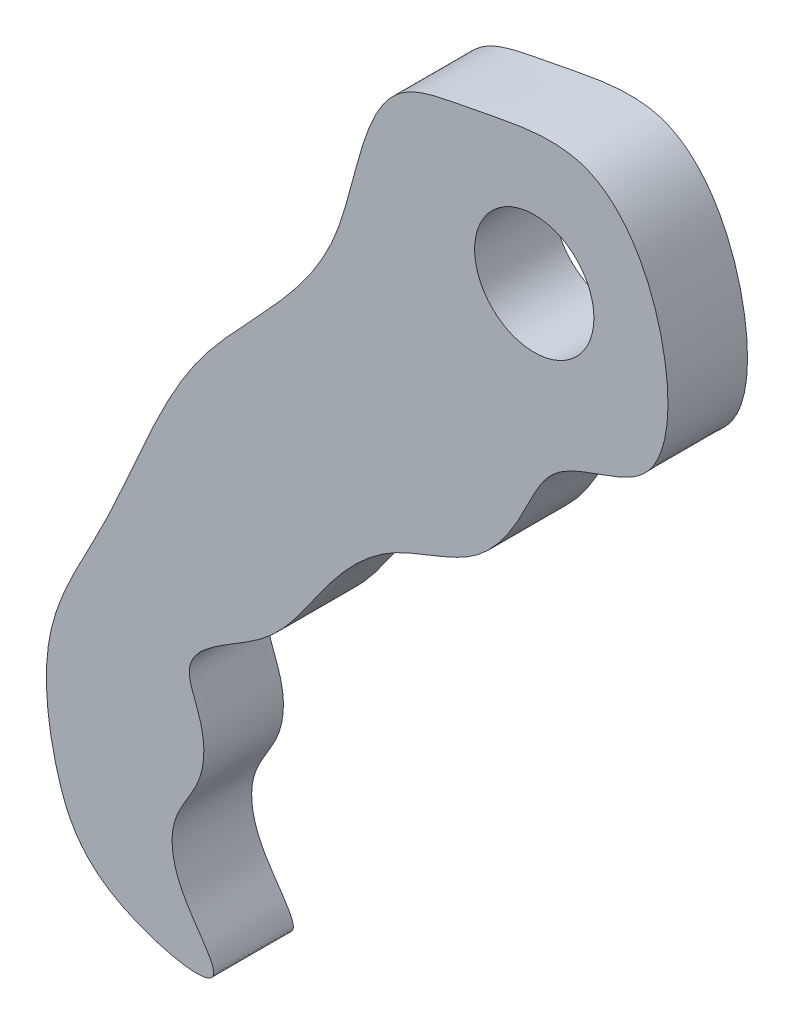
ISO-10303-21;
HEADER;
FILE_DESCRIPTION(('STEP AP214'),'2;1');
FILE_NAME('part.step','',(''),(''),'','','');
FILE_SCHEMA(('AUTOMOTIVE_DESIGN { 1 0 10303 214 1 1 1 1 }'));
ENDSEC;
DATA;
#1=APPLICATION_CONTEXT('core data for automotive mechanical design processes');
#2=APPLICATION_PROTOCOL_DEFINITION('international standard','automotive_design',2000,#1);
#3=PRODUCT_CONTEXT('',#1,'mechanical');
#4=PRODUCT('Part','Part','',(#3));
#5=PRODUCT_RELATED_PRODUCT_CATEGORY('part','',(#4));
#6=PRODUCT_DEFINITION_FORMATION('','',#4);
#7=PRODUCT_DEFINITION_CONTEXT('part definition',#1,'design');
#8=PRODUCT_DEFINITION('design','',#6,#7);
#9=PRODUCT_DEFINITION_SHAPE('','',#8);
#10=(LENGTH_UNIT() NAMED_UNIT(*) SI_UNIT(.MILLI.,.METRE.));
#11=(NAMED_UNIT(*) PLANE_ANGLE_UNIT() SI_UNIT($,.RADIAN.));
#12=(NAMED_UNIT(*) SI_UNIT($,.STERADIAN.) SOLID_ANGLE_UNIT());
#13=UNCERTAINTY_MEASURE_WITH_UNIT(LENGTH_MEASURE(1.E-05),#10,'distance_accuracy_value','');
#14=(GEOMETRIC_REPRESENTATION_CONTEXT(3) GLOBAL_UNCERTAINTY_ASSIGNED_CONTEXT((#13)) GLOBAL_UNIT_ASSIGNED_CONTEXT((#10,
#11,#12)) REPRESENTATION_CONTEXT('',''));
#15=CARTESIAN_POINT('',(0.,0.,0.));
#16=DIRECTION('',(0.,0.,1.));
#17=DIRECTION('',(1.,0.,0.));
#18=AXIS2_PLACEMENT_3D('',#15,#16,#17);
#19=CARTESIAN_POINT('',(256.394257207817,232.56263457874,3.175));
#20=DIRECTION('',(0.,0.,1.));
#21=DIRECTION('',(1.,0.,0.));
#22=AXIS2_PLACEMENT_3D('',#19,#20,#21);
#23=PLANE('',#22);
#24=CARTESIAN_POINT('',(243.379099576045,197.056803539087,3.175));
#25=CARTESIAN_POINT('',(243.273767243135,196.380230237653,3.175));
#26=CARTESIAN_POINT('',(238.482318179912,197.44081115529,3.175));
#27=CARTESIAN_POINT('',(236.878297925177,201.05264219185,3.175));
#28=CARTESIAN_POINT('',(236.364264798995,205.874793844154,3.175));
#29=CARTESIAN_POINT('',(239.690035362537,211.211009055757,3.175));
#30=CARTESIAN_POINT('',(242.060834704179,218.617976604877,3.175));
#31=CARTESIAN_POINT('',(249.033898083895,223.525034572793,3.175));
#32=CARTESIAN_POINT('',(249.293181903686,231.41612249559,3.175));
#33=CARTESIAN_POINT('',(254.255634963251,232.164361696121,3.175));
#34=CARTESIAN_POINT('',(259.020617957375,233.410244688069,3.175));
#35=CARTESIAN_POINT('',(261.864774851715,227.942592224891,3.175));
#36=CARTESIAN_POINT('',(261.400186864981,222.206225967279,3.175));
#37=CARTESIAN_POINT('',(256.854299900074,221.882324012553,3.175));
#38=CARTESIAN_POINT('',(255.672295974055,218.826705659927,3.175));
#39=CARTESIAN_POINT('',(253.830317651431,216.248187104883,3.175));
#40=CARTESIAN_POINT('',(250.236400575657,215.50094268601,3.175));
#41=CARTESIAN_POINT('',(247.560529563968,212.510429102758,3.175));
#42=CARTESIAN_POINT('',(245.811030732394,209.377165959691,3.175));
#43=CARTESIAN_POINT('',(241.728232671508,207.815633376576,3.175));
#44=CARTESIAN_POINT('',(243.083745801627,205.352871589661,3.175));
#45=CARTESIAN_POINT('',(243.001710769164,203.403584428352,3.175));
#46=CARTESIAN_POINT('',(241.529713627467,201.629705159767,3.175));
#47=CARTESIAN_POINT('',(241.781312909838,199.26461384634,3.175));
#48=CARTESIAN_POINT('',(243.445133037225,197.48095133494,3.175));
#49=CARTESIAN_POINT('',(243.379099576045,197.056803539087,3.175));
#50=B_SPLINE_CURVE_WITH_KNOTS('',3,(#24,#25,#26,#27,#28,#29,#30,#31,#32,#33,#34,#35,#36,#37,#38,
#39,#40,#41,#42,#43,#44,#45,#46,#47,#48,#49),.UNSPECIFIED.,.T.,.F.,(4,1,1,1,1,1,1,1,1,1,1,1,1,1,
1,1,1,1,1,1,1,1,1,4),(0.,0.0424500710693778,0.084450706203348,0.131899967472879,
0.185560177459968,0.27818628824314,0.370886872293243,0.444065633915788,0.471111888257913,
0.520415609135808,0.583030286259748,0.631486922398896,0.67177893965033,0.698064997522764,
0.729106003557496,0.768158637626667,0.806911928426185,0.84972621078297,0.888523994468324,
0.904981879557958,0.927291753082426,0.947233337640247,0.973387799903233,1.),.UNSPECIFIED.);
#51=CARTESIAN_POINT('',(243.379099576045,197.056803539087,3.175));
#52=VERTEX_POINT('',#51);
#53=EDGE_CURVE('E13',#52,#52,#50,.T.);
#54=ORIENTED_EDGE('',*,*,#53,.F.);
#55=EDGE_LOOP('',(#54));
#56=FACE_BOUND('',#55,.T.);
#57=CARTESIAN_POINT('',(256.17494294889,227.32559165554,3.175));
#58=DIRECTION('',(0.,0.,1.));
#59=DIRECTION('',(1.,0.,0.));
#60=AXIS2_PLACEMENT_3D('',#57,#58,#59);
#61=CIRCLE('',#60,2.38125);
#62=CARTESIAN_POINT('',(258.55619294889,227.32559165554,3.175));
#63=VERTEX_POINT('',#62);
#64=EDGE_CURVE('E65',#63,#63,#61,.T.);
#65=ORIENTED_EDGE('',*,*,#64,.F.);
#66=EDGE_LOOP('',(#65));
#67=FACE_BOUND('',#66,.T.);
#68=ADVANCED_FACE('F52',(#56,#67),#23,.T.);
#69=CARTESIAN_POINT('',(256.394257207817,232.56263457874,0.));
#70=DIRECTION('',(0.,0.,1.));
#71=DIRECTION('',(1.,0.,0.));
#72=AXIS2_PLACEMENT_3D('',#69,#70,#71);
#73=PLANE('',#72);
#74=CARTESIAN_POINT('',(243.379099576045,197.056803539087,0.));
#75=CARTESIAN_POINT('',(243.273767243135,196.380230237653,0.));
#76=CARTESIAN_POINT('',(238.482318179912,197.44081115529,0.));
#77=CARTESIAN_POINT('',(236.878297925177,201.05264219185,0.));
#78=CARTESIAN_POINT('',(236.364264798995,205.874793844154,0.));
#79=CARTESIAN_POINT('',(239.690035362537,211.211009055757,0.));
#80=CARTESIAN_POINT('',(242.060834704179,218.617976604877,0.));
#81=CARTESIAN_POINT('',(249.033898083895,223.525034572793,0.));
#82=CARTESIAN_POINT('',(249.293181903686,231.41612249559,0.));
#83=CARTESIAN_POINT('',(254.255634963251,232.164361696121,0.));
#84=CARTESIAN_POINT('',(259.020617957375,233.410244688069,0.));
#85=CARTESIAN_POINT('',(261.864774851715,227.942592224891,0.));
#86=CARTESIAN_POINT('',(261.400186864981,222.206225967279,0.));
#87=CARTESIAN_POINT('',(256.854299900074,221.882324012553,0.));
#88=CARTESIAN_POINT('',(255.672295974055,218.826705659927,0.));
#89=CARTESIAN_POINT('',(253.830317651431,216.248187104883,0.));
#90=CARTESIAN_POINT('',(250.236400575657,215.50094268601,0.));
#91=CARTESIAN_POINT('',(247.560529563968,212.510429102758,0.));
#92=CARTESIAN_POINT('',(245.811030732394,209.377165959691,0.));
#93=CARTESIAN_POINT('',(241.728232671508,207.815633376576,0.));
#94=CARTESIAN_POINT('',(243.083745801627,205.352871589661,0.));
#95=CARTESIAN_POINT('',(243.001710769164,203.403584428352,0.));
#96=CARTESIAN_POINT('',(241.529713627467,201.629705159767,0.));
#97=CARTESIAN_POINT('',(241.781312909838,199.26461384634,0.));
#98=CARTESIAN_POINT('',(243.445133037225,197.48095133494,0.));
#99=CARTESIAN_POINT('',(243.379099576045,197.056803539087,0.));
#100=B_SPLINE_CURVE_WITH_KNOTS('',3,(#74,#75,#76,#77,#78,#79,#80,#81,#82,#83,#84,#85,#86,#87,
#88,#89,#90,#91,#92,#93,#94,#95,#96,#97,#98,#99),.UNSPECIFIED.,.T.,.F.,(4,1,1,1,1,1,1,1,1,1,1,1,
1,1,1,1,1,1,1,1,1,1,1,4),(0.,0.0424500710693778,0.084450706203348,0.131899967472879,
0.185560177459968,0.27818628824314,0.370886872293243,0.444065633915788,0.471111888257913,
0.520415609135808,0.583030286259748,0.631486922398896,0.67177893965033,0.698064997522764,
0.729106003557496,0.768158637626667,0.806911928426185,0.84972621078297,0.888523994468324,
0.904981879557958,0.927291753082426,0.947233337640247,0.973387799903233,1.),.UNSPECIFIED.);
#101=CARTESIAN_POINT('',(243.379099576045,197.056803539087,0.));
#102=VERTEX_POINT('',#101);
#103=EDGE_CURVE('E57',#102,#102,#100,.T.);
#104=ORIENTED_EDGE('',*,*,#103,.T.);
#105=EDGE_LOOP('',(#104));
#106=FACE_BOUND('',#105,.T.);
#107=CARTESIAN_POINT('',(256.17494294889,227.32559165554,0.));
#108=DIRECTION('',(0.,0.,1.));
#109=DIRECTION('',(1.,0.,0.));
#110=AXIS2_PLACEMENT_3D('',#107,#108,#109);
#111=CIRCLE('',#110,2.38125);
#112=CARTESIAN_POINT('',(258.55619294889,227.32559165554,0.));
#113=VERTEX_POINT('',#112);
#114=EDGE_CURVE('E70',#113,#113,#111,.T.);
#115=ORIENTED_EDGE('',*,*,#114,.T.);
#116=EDGE_LOOP('',(#115));
#117=FACE_BOUND('',#116,.T.);
#118=ADVANCED_FACE('F83',(#106,#117),#73,.F.);
#119=DIRECTION('',(0.,0.,-1.));
#120=VECTOR('',#119,1.);
#121=SURFACE_OF_LINEAR_EXTRUSION('',#50,#120);
#122=ORIENTED_EDGE('',*,*,#53,.T.);
#123=EDGE_LOOP('',(#122));
#124=FACE_BOUND('',#123,.T.);
#125=ORIENTED_EDGE('',*,*,#103,.F.);
#126=EDGE_LOOP('',(#125));
#127=FACE_BOUND('',#126,.T.);
#128=ADVANCED_FACE('F54',(#124,#127),#121,.T.);
#129=CARTESIAN_POINT('',(256.17494294889,227.32559165554,3.175));
#130=DIRECTION('',(0.,0.,-1.));
#131=DIRECTION('',(-1.,0.,0.));
#132=AXIS2_PLACEMENT_3D('',#129,#130,#131);
#133=CYLINDRICAL_SURFACE('',#132,2.38125);
#134=ORIENTED_EDGE('',*,*,#64,.T.);
#135=EDGE_LOOP('',(#134));
#136=FACE_BOUND('',#135,.T.);
#137=ORIENTED_EDGE('',*,*,#114,.F.);
#138=EDGE_LOOP('',(#137));
#139=FACE_BOUND('',#138,.T.);
#140=ADVANCED_FACE('F79',(#136,#139),#133,.F.);
#141=CLOSED_SHELL('',(#68,#118,#128,#140));
#142=MANIFOLD_SOLID_BREP('B2',#141);
#143=ADVANCED_BREP_SHAPE_REPRESENTATION('',(#18,#142),#14);
#144=SHAPE_DEFINITION_REPRESENTATION(#9,#143);
ENDSEC;
END-ISO-10303-21;
